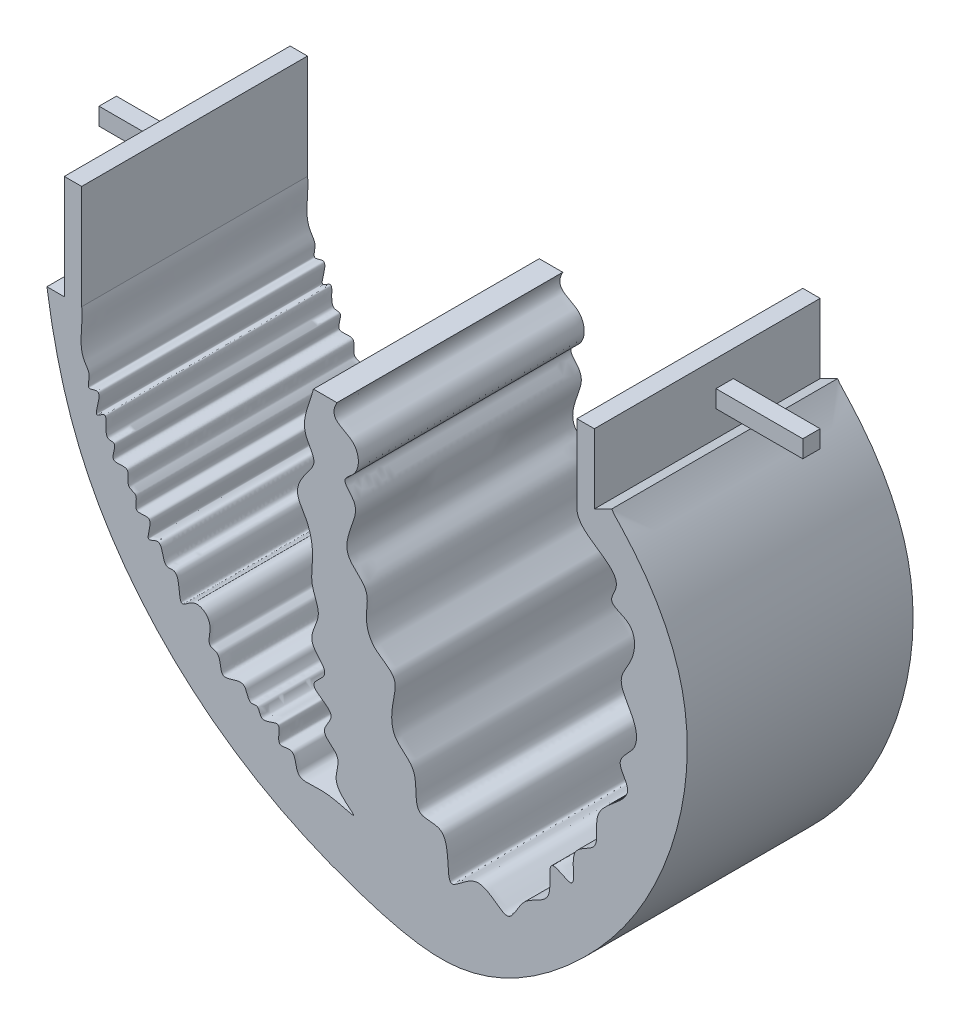
ISO-10303-21;
HEADER;
FILE_DESCRIPTION(('STEP AP214'),'2;1');
FILE_NAME('part.step','',(''),(''),'','','');
FILE_SCHEMA(('AUTOMOTIVE_DESIGN { 1 0 10303 214 1 1 1 1 }'));
ENDSEC;
DATA;
#1=APPLICATION_CONTEXT('core data for automotive mechanical design processes');
#2=APPLICATION_PROTOCOL_DEFINITION('international standard','automotive_design',2000,#1);
#3=PRODUCT_CONTEXT('',#1,'mechanical');
#4=PRODUCT('Part','Part','',(#3));
#5=PRODUCT_RELATED_PRODUCT_CATEGORY('part','',(#4));
#6=PRODUCT_DEFINITION_FORMATION('','',#4);
#7=PRODUCT_DEFINITION_CONTEXT('part definition',#1,'design');
#8=PRODUCT_DEFINITION('design','',#6,#7);
#9=PRODUCT_DEFINITION_SHAPE('','',#8);
#10=(LENGTH_UNIT() NAMED_UNIT(*) SI_UNIT(.MILLI.,.METRE.));
#11=(NAMED_UNIT(*) PLANE_ANGLE_UNIT() SI_UNIT($,.RADIAN.));
#12=(NAMED_UNIT(*) SI_UNIT($,.STERADIAN.) SOLID_ANGLE_UNIT());
#13=UNCERTAINTY_MEASURE_WITH_UNIT(LENGTH_MEASURE(1.E-05),#10,'distance_accuracy_value','');
#14=(GEOMETRIC_REPRESENTATION_CONTEXT(3) GLOBAL_UNCERTAINTY_ASSIGNED_CONTEXT((#13)) GLOBAL_UNIT_ASSIGNED_CONTEXT((#10,
#11,#12)) REPRESENTATION_CONTEXT('',''));
#15=CARTESIAN_POINT('',(0.,0.,0.));
#16=DIRECTION('',(0.,0.,1.));
#17=DIRECTION('',(1.,0.,0.));
#18=AXIS2_PLACEMENT_3D('',#15,#16,#17);
#19=CARTESIAN_POINT('',(236.028465064925,325.589175179673,33.02));
#20=DIRECTION('',(-1.,0.,0.));
#21=DIRECTION('',(0.,0.,1.));
#22=AXIS2_PLACEMENT_3D('',#19,#20,#21);
#23=PLANE('',#22);
#24=DIRECTION('',(0.,1.,0.));
#25=VECTOR('',#24,1.);
#26=CARTESIAN_POINT('',(236.028465064925,325.589175179673,0.));
#27=LINE('',#26,#25);
#28=CARTESIAN_POINT('',(236.028465064925,315.429175179673,0.));
#29=VERTEX_POINT('',#28);
#30=CARTESIAN_POINT('',(236.028465064925,325.589175179673,0.));
#31=VERTEX_POINT('',#30);
#32=EDGE_CURVE('E698',#29,#31,#27,.T.);
#33=ORIENTED_EDGE('',*,*,#32,.T.);
#34=DIRECTION('',(0.,0.,-1.));
#35=VECTOR('',#34,1.);
#36=CARTESIAN_POINT('',(236.028465064925,325.589175179673,33.02));
#37=LINE('',#36,#35);
#38=CARTESIAN_POINT('',(236.028465064925,325.589175179673,33.02));
#39=VERTEX_POINT('',#38);
#40=EDGE_CURVE('E705',#39,#31,#37,.T.);
#41=ORIENTED_EDGE('',*,*,#40,.F.);
#42=DIRECTION('',(0.,1.,0.));
#43=VECTOR('',#42,1.);
#44=CARTESIAN_POINT('',(236.028465064925,325.589175179673,33.02));
#45=LINE('',#44,#43);
#46=CARTESIAN_POINT('',(236.028465064925,315.429175179673,33.02));
#47=VERTEX_POINT('',#46);
#48=EDGE_CURVE('E703',#47,#39,#45,.T.);
#49=ORIENTED_EDGE('',*,*,#48,.F.);
#50=DIRECTION('',(0.,0.,-1.));
#51=VECTOR('',#50,1.);
#52=CARTESIAN_POINT('',(236.028465064925,315.429175179673,33.02));
#53=LINE('',#52,#51);
#54=EDGE_CURVE('E691',#47,#29,#53,.T.);
#55=ORIENTED_EDGE('',*,*,#54,.T.);
#56=EDGE_LOOP('',(#33,#41,#49,#55));
#57=FACE_BOUND('',#56,.T.);
#58=DIRECTION('',(0.,1.,0.));
#59=VECTOR('',#58,1.);
#60=CARTESIAN_POINT('',(236.028465064925,321.779175179673,12.7));
#61=LINE('',#60,#59);
#62=CARTESIAN_POINT('',(236.028465064925,319.239175179673,12.7));
#63=VERTEX_POINT('',#62);
#64=CARTESIAN_POINT('',(236.028465064925,321.779175179673,12.7));
#65=VERTEX_POINT('',#64);
#66=EDGE_CURVE('E211',#63,#65,#61,.T.);
#67=ORIENTED_EDGE('',*,*,#66,.F.);
#68=DIRECTION('',(0.,0.,-1.));
#69=VECTOR('',#68,1.);
#70=CARTESIAN_POINT('',(236.028465064925,319.239175179673,15.24));
#71=LINE('',#70,#69);
#72=CARTESIAN_POINT('',(236.028465064925,319.239175179673,15.24));
#73=VERTEX_POINT('',#72);
#74=EDGE_CURVE('E208',#73,#63,#71,.T.);
#75=ORIENTED_EDGE('',*,*,#74,.F.);
#76=DIRECTION('',(0.,-1.,0.));
#77=VECTOR('',#76,1.);
#78=CARTESIAN_POINT('',(236.028465064925,321.779175179673,15.24));
#79=LINE('',#78,#77);
#80=CARTESIAN_POINT('',(236.028465064925,321.779175179673,15.24));
#81=VERTEX_POINT('',#80);
#82=EDGE_CURVE('E72',#81,#73,#79,.T.);
#83=ORIENTED_EDGE('',*,*,#82,.F.);
#84=DIRECTION('',(0.,0.,1.));
#85=VECTOR('',#84,1.);
#86=CARTESIAN_POINT('',(236.028465064925,321.779175179673,15.24));
#87=LINE('',#86,#85);
#88=EDGE_CURVE('E67',#65,#81,#87,.T.);
#89=ORIENTED_EDGE('',*,*,#88,.F.);
#90=EDGE_LOOP('',(#67,#75,#83,#89));
#91=FACE_BOUND('',#90,.T.);
#92=ADVANCED_FACE('F51',(#57,#91),#23,.F.);
#93=CARTESIAN_POINT('',(158.529333214009,303.552172989733,33.02));
#94=DIRECTION('',(1.,0.,0.));
#95=DIRECTION('',(0.,1.,0.));
#96=AXIS2_PLACEMENT_3D('',#93,#94,#95);
#97=PLANE('',#96);
#98=DIRECTION('',(0.,-1.,0.));
#99=VECTOR('',#98,1.);
#100=CARTESIAN_POINT('',(158.529333214009,303.552172989733,0.));
#101=LINE('',#100,#99);
#102=CARTESIAN_POINT('',(158.529333214009,318.792172989733,0.));
#103=VERTEX_POINT('',#102);
#104=CARTESIAN_POINT('',(158.529333214009,303.552172989733,0.));
#105=VERTEX_POINT('',#104);
#106=EDGE_CURVE('E264',#103,#105,#101,.T.);
#107=ORIENTED_EDGE('',*,*,#106,.T.);
#108=DIRECTION('',(0.,0.,-1.));
#109=VECTOR('',#108,1.);
#110=CARTESIAN_POINT('',(158.529333214009,303.552172989733,33.02));
#111=LINE('',#110,#109);
#112=CARTESIAN_POINT('',(158.529333214009,303.552172989733,33.02));
#113=VERTEX_POINT('',#112);
#114=EDGE_CURVE('E11',#113,#105,#111,.T.);
#115=ORIENTED_EDGE('',*,*,#114,.F.);
#116=DIRECTION('',(0.,-1.,0.));
#117=VECTOR('',#116,1.);
#118=CARTESIAN_POINT('',(158.529333214009,303.552172989733,33.02));
#119=LINE('',#118,#117);
#120=CARTESIAN_POINT('',(158.529333214009,318.792172989733,33.02));
#121=VERTEX_POINT('',#120);
#122=EDGE_CURVE('E265',#121,#113,#119,.T.);
#123=ORIENTED_EDGE('',*,*,#122,.F.);
#124=DIRECTION('',(0.,0.,-1.));
#125=VECTOR('',#124,1.);
#126=CARTESIAN_POINT('',(158.529333214009,318.792172989733,33.02));
#127=LINE('',#126,#125);
#128=EDGE_CURVE('E744',#121,#103,#127,.T.);
#129=ORIENTED_EDGE('',*,*,#128,.T.);
#130=EDGE_LOOP('',(#107,#115,#123,#129));
#131=FACE_BOUND('',#130,.T.);
#132=DIRECTION('',(0.,1.,0.));
#133=VECTOR('',#132,1.);
#134=CARTESIAN_POINT('',(158.529333214009,312.442172989733,15.24));
#135=LINE('',#134,#133);
#136=CARTESIAN_POINT('',(158.529333214009,309.902172989733,15.24));
#137=VERTEX_POINT('',#136);
#138=CARTESIAN_POINT('',(158.529333214009,312.442172989733,15.24));
#139=VERTEX_POINT('',#138);
#140=EDGE_CURVE('E213',#137,#139,#135,.T.);
#141=ORIENTED_EDGE('',*,*,#140,.F.);
#142=DIRECTION('',(0.,0.,1.));
#143=VECTOR('',#142,1.);
#144=CARTESIAN_POINT('',(158.529333214009,309.902172989733,12.7));
#145=LINE('',#144,#143);
#146=CARTESIAN_POINT('',(158.529333214009,309.902172989733,12.7));
#147=VERTEX_POINT('',#146);
#148=EDGE_CURVE('E229',#147,#137,#145,.T.);
#149=ORIENTED_EDGE('',*,*,#148,.F.);
#150=DIRECTION('',(0.,-1.,0.));
#151=VECTOR('',#150,1.);
#152=CARTESIAN_POINT('',(158.529333214009,312.442172989733,12.7));
#153=LINE('',#152,#151);
#154=CARTESIAN_POINT('',(158.529333214009,312.442172989733,12.7));
#155=VERTEX_POINT('',#154);
#156=EDGE_CURVE('E242',#155,#147,#153,.T.);
#157=ORIENTED_EDGE('',*,*,#156,.F.);
#158=DIRECTION('',(0.,0.,-1.));
#159=VECTOR('',#158,1.);
#160=CARTESIAN_POINT('',(158.529333214009,312.442172989733,12.7));
#161=LINE('',#160,#159);
#162=EDGE_CURVE('E218',#139,#155,#161,.T.);
#163=ORIENTED_EDGE('',*,*,#162,.F.);
#164=EDGE_LOOP('',(#141,#149,#157,#163));
#165=FACE_BOUND('',#164,.T.);
#166=ADVANCED_FACE('F53',(#131,#165),#97,.F.);
#167=CARTESIAN_POINT('',(155.989333214009,303.552172989734,33.02));
#168=DIRECTION('',(-2.18547839493142E-13,-1.,0.));
#169=DIRECTION('',(1.,-2.18547839493142E-13,0.));
#170=AXIS2_PLACEMENT_3D('',#167,#168,#169);
#171=PLANE('',#170);
#172=DIRECTION('',(-1.,2.18547839493142E-13,0.));
#173=VECTOR('',#172,1.);
#174=CARTESIAN_POINT('',(155.989333214009,303.552172989734,0.));
#175=LINE('',#174,#173);
#176=CARTESIAN_POINT('',(155.989333214009,303.552172989734,0.));
#177=VERTEX_POINT('',#176);
#178=EDGE_CURVE('E780',#105,#177,#175,.T.);
#179=ORIENTED_EDGE('',*,*,#178,.T.);
#180=DIRECTION('',(0.,0.,-1.));
#181=VECTOR('',#180,1.);
#182=CARTESIAN_POINT('',(155.989333214009,303.552172989734,33.02));
#183=LINE('',#182,#181);
#184=CARTESIAN_POINT('',(155.989333214009,303.552172989734,33.02));
#185=VERTEX_POINT('',#184);
#186=EDGE_CURVE('E60',#185,#177,#183,.T.);
#187=ORIENTED_EDGE('',*,*,#186,.F.);
#188=DIRECTION('',(-1.,2.18547839493142E-13,0.));
#189=VECTOR('',#188,1.);
#190=CARTESIAN_POINT('',(155.989333214009,303.552172989734,33.02));
#191=LINE('',#190,#189);
#192=EDGE_CURVE('E269',#113,#185,#191,.T.);
#193=ORIENTED_EDGE('',*,*,#192,.F.);
#194=ORIENTED_EDGE('',*,*,#114,.T.);
#195=EDGE_LOOP('',(#179,#187,#193,#194));
#196=FACE_BOUND('',#195,.T.);
#197=ADVANCED_FACE('F289',(#196),#171,.F.);
#198=CARTESIAN_POINT('',(155.989333214009,303.552172989734,33.02));
#199=CARTESIAN_POINT('',(156.987406159958,296.711766362536,33.02));
#200=CARTESIAN_POINT('',(160.903271146754,280.758367255002,33.02));
#201=CARTESIAN_POINT('',(177.679801190773,260.252616427949,33.02));
#202=CARTESIAN_POINT('',(198.008810057512,250.052656776356,33.02));
#203=CARTESIAN_POINT('',(218.121524922759,245.457478504978,33.02));
#204=CARTESIAN_POINT('',(234.434067504064,256.063238467454,33.02));
#205=CARTESIAN_POINT('',(247.820952481392,274.206001168337,33.02));
#206=CARTESIAN_POINT('',(252.025485833664,297.864311981296,33.02));
#207=CARTESIAN_POINT('',(243.492208313162,311.503972459356,33.02));
#208=CARTESIAN_POINT('',(238.944116052718,316.140928761056,33.02));
#209=CARTESIAN_POINT('',(238.568465064925,316.699175179673,33.02));
#210=B_SPLINE_CURVE_WITH_KNOTS('',3,(#198,#199,#200,#201,#202,#203,#204,#205,#206,#207,#208,
#209),.UNSPECIFIED.,.F.,.F.,(4,1,1,1,1,1,1,1,1,4),(0.120046571813157,0.18483385758498,
0.273021776294878,0.359649236978444,0.397816633725217,0.461195161311988,0.526426676141084,
0.612455038105468,0.666069006609974,0.672633998429617),.UNSPECIFIED.);
#211=DIRECTION('',(0.,0.,-1.));
#212=VECTOR('',#211,1.);
#213=SURFACE_OF_LINEAR_EXTRUSION('',#210,#212);
#214=CARTESIAN_POINT('',(155.989333214009,303.552172989734,0.));
#215=CARTESIAN_POINT('',(156.987406159958,296.711766362536,0.));
#216=CARTESIAN_POINT('',(160.903271146754,280.758367255002,0.));
#217=CARTESIAN_POINT('',(177.679801190773,260.252616427949,0.));
#218=CARTESIAN_POINT('',(198.008810057512,250.052656776356,0.));
#219=CARTESIAN_POINT('',(218.121524922759,245.457478504978,0.));
#220=CARTESIAN_POINT('',(234.434067504064,256.063238467454,0.));
#221=CARTESIAN_POINT('',(247.820952481392,274.206001168337,0.));
#222=CARTESIAN_POINT('',(252.025485833664,297.864311981296,0.));
#223=CARTESIAN_POINT('',(243.492208313162,311.503972459356,0.));
#224=CARTESIAN_POINT('',(238.944116052718,316.140928761056,0.));
#225=CARTESIAN_POINT('',(238.568465064925,316.699175179673,0.));
#226=B_SPLINE_CURVE_WITH_KNOTS('',3,(#214,#215,#216,#217,#218,#219,#220,#221,#222,#223,#224,
#225),.UNSPECIFIED.,.F.,.F.,(4,1,1,1,1,1,1,1,1,4),(0.120046571813157,0.18483385758498,
0.273021776294878,0.359649236978444,0.397816633725217,0.461195161311988,0.526426676141084,
0.612455038105468,0.666069006609974,0.672633998429617),.UNSPECIFIED.);
#227=CARTESIAN_POINT('',(238.568465064925,316.699175179673,0.));
#228=VERTEX_POINT('',#227);
#229=EDGE_CURVE('E699',#177,#228,#226,.T.);
#230=ORIENTED_EDGE('',*,*,#229,.T.);
#231=DIRECTION('',(0.,0.,-1.));
#232=VECTOR('',#231,1.);
#233=CARTESIAN_POINT('',(238.568465064925,316.699175179673,33.02));
#234=LINE('',#233,#232);
#235=CARTESIAN_POINT('',(238.568465064925,316.699175179673,33.02));
#236=VERTEX_POINT('',#235);
#237=EDGE_CURVE('E694',#236,#228,#234,.T.);
#238=ORIENTED_EDGE('',*,*,#237,.F.);
#239=EDGE_CURVE('E273',#185,#236,#210,.T.);
#240=ORIENTED_EDGE('',*,*,#239,.F.);
#241=ORIENTED_EDGE('',*,*,#186,.T.);
#242=EDGE_LOOP('',(#230,#238,#240,#241));
#243=FACE_BOUND('',#242,.T.);
#244=ADVANCED_FACE('F285',(#243),#213,.F.);
#245=CARTESIAN_POINT('',(236.028465064925,315.429175179673,33.02));
#246=DIRECTION('',(0.447213595499958,-0.894427190999916,0.));
#247=DIRECTION('',(0.894427190999916,0.447213595499958,0.));
#248=AXIS2_PLACEMENT_3D('',#245,#246,#247);
#249=PLANE('',#248);
#250=DIRECTION('',(-0.894427190999916,-0.447213595499958,0.));
#251=VECTOR('',#250,1.);
#252=CARTESIAN_POINT('',(236.028465064925,315.429175179673,0.));
#253=LINE('',#252,#251);
#254=EDGE_CURVE('E688',#228,#29,#253,.T.);
#255=ORIENTED_EDGE('',*,*,#254,.T.);
#256=ORIENTED_EDGE('',*,*,#54,.F.);
#257=DIRECTION('',(-0.894427190999916,-0.447213595499958,0.));
#258=VECTOR('',#257,1.);
#259=CARTESIAN_POINT('',(236.028465064925,315.429175179673,33.02));
#260=LINE('',#259,#258);
#261=EDGE_CURVE('E279',#236,#47,#260,.T.);
#262=ORIENTED_EDGE('',*,*,#261,.F.);
#263=ORIENTED_EDGE('',*,*,#237,.T.);
#264=EDGE_LOOP('',(#255,#256,#262,#263));
#265=FACE_BOUND('',#264,.T.);
#266=ADVANCED_FACE('F288',(#265),#249,.F.);
#267=CARTESIAN_POINT('',(233.488465064925,325.589175179673,33.02));
#268=DIRECTION('',(0.,-1.,0.));
#269=DIRECTION('',(0.,0.,-1.));
#270=AXIS2_PLACEMENT_3D('',#267,#268,#269);
#271=PLANE('',#270);
#272=DIRECTION('',(-1.,0.,0.));
#273=VECTOR('',#272,1.);
#274=CARTESIAN_POINT('',(233.488465064925,325.589175179673,0.));
#275=LINE('',#274,#273);
#276=CARTESIAN_POINT('',(233.488465064925,325.589175179673,0.));
#277=VERTEX_POINT('',#276);
#278=EDGE_CURVE('E710',#31,#277,#275,.T.);
#279=ORIENTED_EDGE('',*,*,#278,.T.);
#280=DIRECTION('',(0.,0.,-1.));
#281=VECTOR('',#280,1.);
#282=CARTESIAN_POINT('',(233.488465064925,325.589175179673,33.02));
#283=LINE('',#282,#281);
#284=CARTESIAN_POINT('',(233.488465064925,325.589175179673,33.02));
#285=VERTEX_POINT('',#284);
#286=EDGE_CURVE('E769',#285,#277,#283,.T.);
#287=ORIENTED_EDGE('',*,*,#286,.F.);
#288=DIRECTION('',(-1.,0.,0.));
#289=VECTOR('',#288,1.);
#290=CARTESIAN_POINT('',(233.488465064925,325.589175179673,33.02));
#291=LINE('',#290,#289);
#292=EDGE_CURVE('E816',#39,#285,#291,.T.);
#293=ORIENTED_EDGE('',*,*,#292,.F.);
#294=ORIENTED_EDGE('',*,*,#40,.T.);
#295=EDGE_LOOP('',(#279,#287,#293,#294));
#296=FACE_BOUND('',#295,.T.);
#297=ADVANCED_FACE('F303',(#296),#271,.F.);
#298=CARTESIAN_POINT('',(233.488465064925,314.159175179673,33.02));
#299=DIRECTION('',(1.,0.,0.));
#300=DIRECTION('',(0.,0.,-1.));
#301=AXIS2_PLACEMENT_3D('',#298,#299,#300);
#302=PLANE('',#301);
#303=DIRECTION('',(0.,-1.,0.));
#304=VECTOR('',#303,1.);
#305=CARTESIAN_POINT('',(233.488465064925,314.159175179673,0.));
#306=LINE('',#305,#304);
#307=CARTESIAN_POINT('',(233.488465064925,314.159175179673,0.));
#308=VERTEX_POINT('',#307);
#309=EDGE_CURVE('E714',#277,#308,#306,.T.);
#310=ORIENTED_EDGE('',*,*,#309,.T.);
#311=DIRECTION('',(0.,0.,-1.));
#312=VECTOR('',#311,1.);
#313=CARTESIAN_POINT('',(233.488465064925,314.159175179673,33.02));
#314=LINE('',#313,#312);
#315=CARTESIAN_POINT('',(233.488465064925,314.159175179673,33.02));
#316=VERTEX_POINT('',#315);
#317=EDGE_CURVE('E765',#316,#308,#314,.T.);
#318=ORIENTED_EDGE('',*,*,#317,.F.);
#319=DIRECTION('',(0.,-1.,0.));
#320=VECTOR('',#319,1.);
#321=CARTESIAN_POINT('',(233.488465064925,314.159175179673,33.02));
#322=LINE('',#321,#320);
#323=EDGE_CURVE('E326',#285,#316,#322,.T.);
#324=ORIENTED_EDGE('',*,*,#323,.F.);
#325=ORIENTED_EDGE('',*,*,#286,.T.);
#326=EDGE_LOOP('',(#310,#318,#324,#325));
#327=FACE_BOUND('',#326,.T.);
#328=ADVANCED_FACE('F306',(#327),#302,.F.);
#329=CARTESIAN_POINT('',(233.488465064925,314.159175179673,33.02));
#330=CARTESIAN_POINT('',(233.624093519787,310.940387087335,33.02));
#331=CARTESIAN_POINT('',(241.380007541965,309.731740834387,33.02));
#332=CARTESIAN_POINT('',(237.762307949822,304.589064021756,33.02));
#333=CARTESIAN_POINT('',(242.26398275502,303.759120411359,33.02));
#334=CARTESIAN_POINT('',(242.01925976625,299.108516822041,33.02));
#335=CARTESIAN_POINT('',(238.840035328221,295.472438397845,33.02));
#336=CARTESIAN_POINT('',(242.168835112555,291.954059873382,33.02));
#337=CARTESIAN_POINT('',(242.425224320468,287.719555435332,33.02));
#338=CARTESIAN_POINT('',(238.737962858199,285.53946318489,33.02));
#339=CARTESIAN_POINT('',(242.876248600483,281.000941917249,33.02));
#340=CARTESIAN_POINT('',(234.985597895886,278.53919876278,33.02));
#341=CARTESIAN_POINT('',(237.304339276124,272.136674758564,33.02));
#342=CARTESIAN_POINT('',(231.790307916197,271.359891368271,33.02));
#343=CARTESIAN_POINT('',(234.027175710773,264.774709841451,33.02));
#344=CARTESIAN_POINT('',(228.664536323079,268.78237464891,33.02));
#345=CARTESIAN_POINT('',(230.55668082613,261.889000265188,33.02));
#346=CARTESIAN_POINT('',(225.409102594152,261.68182482677,33.02));
#347=CARTESIAN_POINT('',(223.596574731169,255.475841935516,33.02));
#348=CARTESIAN_POINT('',(219.255508952706,261.805020981885,33.02));
#349=CARTESIAN_POINT('',(213.548343037484,254.514732363035,33.02));
#350=CARTESIAN_POINT('',(215.615196685254,264.580704600301,33.02));
#351=CARTESIAN_POINT('',(209.076320883539,263.282570459479,33.02));
#352=CARTESIAN_POINT('',(210.833311208291,269.39823245045,33.02));
#353=CARTESIAN_POINT('',(206.311013714804,271.504161156031,33.02));
#354=CARTESIAN_POINT('',(206.292511733879,275.64360221575,33.02));
#355=CARTESIAN_POINT('',(207.574345548483,279.828476811275,33.02));
#356=CARTESIAN_POINT('',(203.462625416771,281.407786433713,33.02));
#357=CARTESIAN_POINT('',(202.363477488807,284.972651492577,33.02));
#358=CARTESIAN_POINT('',(203.418983169135,288.860017945739,33.02));
#359=CARTESIAN_POINT('',(198.999345505098,291.241370349473,33.02));
#360=CARTESIAN_POINT('',(200.484757513914,295.388724215384,33.02));
#361=CARTESIAN_POINT('',(201.665933406577,298.681721158022,33.02));
#362=CARTESIAN_POINT('',(198.739876768285,300.84093546565,33.02));
#363=CARTESIAN_POINT('',(201.834910174568,302.516226463252,33.02));
#364=CARTESIAN_POINT('',(201.603096528386,307.518127742564,33.02));
#365=CARTESIAN_POINT('',(196.915447652843,307.348988540126,33.02));
#366=CARTESIAN_POINT('',(198.39389774547,310.074192577295,33.02));
#367=B_SPLINE_CURVE_WITH_KNOTS('',3,(#329,#330,#331,#332,#333,#334,#335,#336,#337,#338,#339,
#340,#341,#342,#343,#344,#345,#346,#347,#348,#349,#350,#351,#352,#353,#354,#355,#356,#357,#358,
#359,#360,#361,#362,#363,#364,#365,#366),.UNSPECIFIED.,.F.,.F.,(4,1,1,1,1,1,1,1,1,1,1,1,1,1,1,1,
1,1,1,1,1,1,1,1,1,1,1,1,1,1,1,1,1,1,1,4),(0.,0.0659429892320501,0.0794246481148736,
0.0993540806289712,0.131544493456022,0.156724893871502,0.192388626615118,0.215230881716891,
0.239992462921353,0.259372000988837,0.310606599398988,0.340323445588698,0.366751299412639,
0.395597338762441,0.414913607870548,0.442500702898158,0.475568268374796,0.502327013143903,
0.537353293074238,0.567793948562489,0.611750497809385,0.631954373675336,0.668088076837531,
0.694441930718634,0.723930439646877,0.748711561920439,0.775177792035775,0.799975042034869,
0.823243722437977,0.852303896363902,0.882510550816387,0.904823446612042,0.921786690536577,
0.935134313462108,0.96244502172824,1.),.UNSPECIFIED.);
#368=DIRECTION('',(0.,0.,-1.));
#369=VECTOR('',#368,1.);
#370=SURFACE_OF_LINEAR_EXTRUSION('',#367,#369);
#371=CARTESIAN_POINT('',(233.488465064925,314.159175179673,0.));
#372=CARTESIAN_POINT('',(233.624093519787,310.940387087335,0.));
#373=CARTESIAN_POINT('',(241.380007541965,309.731740834387,0.));
#374=CARTESIAN_POINT('',(237.762307949822,304.589064021756,0.));
#375=CARTESIAN_POINT('',(242.26398275502,303.759120411359,0.));
#376=CARTESIAN_POINT('',(242.01925976625,299.108516822041,0.));
#377=CARTESIAN_POINT('',(238.840035328221,295.472438397845,0.));
#378=CARTESIAN_POINT('',(242.168835112555,291.954059873382,0.));
#379=CARTESIAN_POINT('',(242.425224320468,287.719555435332,0.));
#380=CARTESIAN_POINT('',(238.737962858199,285.53946318489,0.));
#381=CARTESIAN_POINT('',(242.876248600483,281.000941917249,0.));
#382=CARTESIAN_POINT('',(234.985597895886,278.53919876278,0.));
#383=CARTESIAN_POINT('',(237.304339276124,272.136674758564,0.));
#384=CARTESIAN_POINT('',(231.790307916197,271.359891368271,0.));
#385=CARTESIAN_POINT('',(234.027175710773,264.774709841451,0.));
#386=CARTESIAN_POINT('',(228.664536323079,268.78237464891,0.));
#387=CARTESIAN_POINT('',(230.55668082613,261.889000265188,0.));
#388=CARTESIAN_POINT('',(225.409102594152,261.68182482677,0.));
#389=CARTESIAN_POINT('',(223.596574731169,255.475841935516,0.));
#390=CARTESIAN_POINT('',(219.255508952706,261.805020981885,0.));
#391=CARTESIAN_POINT('',(213.548343037484,254.514732363035,0.));
#392=CARTESIAN_POINT('',(215.615196685254,264.580704600301,0.));
#393=CARTESIAN_POINT('',(209.076320883539,263.282570459479,0.));
#394=CARTESIAN_POINT('',(210.833311208291,269.39823245045,0.));
#395=CARTESIAN_POINT('',(206.311013714804,271.504161156031,0.));
#396=CARTESIAN_POINT('',(206.292511733879,275.64360221575,0.));
#397=CARTESIAN_POINT('',(207.574345548483,279.828476811275,0.));
#398=CARTESIAN_POINT('',(203.462625416771,281.407786433713,0.));
#399=CARTESIAN_POINT('',(202.363477488807,284.972651492577,0.));
#400=CARTESIAN_POINT('',(203.418983169135,288.860017945739,0.));
#401=CARTESIAN_POINT('',(198.999345505098,291.241370349473,0.));
#402=CARTESIAN_POINT('',(200.484757513914,295.388724215384,0.));
#403=CARTESIAN_POINT('',(201.665933406577,298.681721158022,0.));
#404=CARTESIAN_POINT('',(198.739876768285,300.84093546565,0.));
#405=CARTESIAN_POINT('',(201.834910174568,302.516226463252,0.));
#406=CARTESIAN_POINT('',(201.603096528386,307.518127742564,0.));
#407=CARTESIAN_POINT('',(196.915447652843,307.348988540126,0.));
#408=CARTESIAN_POINT('',(198.39389774547,310.074192577295,0.));
#409=B_SPLINE_CURVE_WITH_KNOTS('',3,(#371,#372,#373,#374,#375,#376,#377,#378,#379,#380,#381,
#382,#383,#384,#385,#386,#387,#388,#389,#390,#391,#392,#393,#394,#395,#396,#397,#398,#399,#400,
#401,#402,#403,#404,#405,#406,#407,#408),.UNSPECIFIED.,.F.,.F.,(4,1,1,1,1,1,1,1,1,1,1,1,1,1,1,1,
1,1,1,1,1,1,1,1,1,1,1,1,1,1,1,1,1,1,1,4),(0.,0.0659429892320501,0.0794246481148736,
0.0993540806289712,0.131544493456022,0.156724893871502,0.192388626615118,0.215230881716891,
0.239992462921353,0.259372000988837,0.310606599398988,0.340323445588698,0.366751299412639,
0.395597338762441,0.414913607870548,0.442500702898158,0.475568268374796,0.502327013143903,
0.537353293074238,0.567793948562489,0.611750497809385,0.631954373675336,0.668088076837531,
0.694441930718634,0.723930439646877,0.748711561920439,0.775177792035775,0.799975042034869,
0.823243722437977,0.852303896363902,0.882510550816387,0.904823446612042,0.921786690536577,
0.935134313462108,0.96244502172824,1.),.UNSPECIFIED.);
#410=CARTESIAN_POINT('',(198.39389774547,310.074192577295,0.));
#411=VERTEX_POINT('',#410);
#412=EDGE_CURVE('E720',#308,#411,#409,.T.);
#413=ORIENTED_EDGE('',*,*,#412,.T.);
#414=DIRECTION('',(0.,0.,-1.));
#415=VECTOR('',#414,1.);
#416=CARTESIAN_POINT('',(198.39389774547,310.074192577295,33.02));
#417=LINE('',#416,#415);
#418=CARTESIAN_POINT('',(198.39389774547,310.074192577295,33.02));
#419=VERTEX_POINT('',#418);
#420=EDGE_CURVE('E761',#419,#411,#417,.T.);
#421=ORIENTED_EDGE('',*,*,#420,.F.);
#422=EDGE_CURVE('E318',#316,#419,#367,.T.);
#423=ORIENTED_EDGE('',*,*,#422,.F.);
#424=ORIENTED_EDGE('',*,*,#317,.T.);
#425=EDGE_LOOP('',(#413,#421,#423,#424));
#426=FACE_BOUND('',#425,.T.);
#427=ADVANCED_FACE('F310',(#426),#370,.F.);
#428=CARTESIAN_POINT('',(194.95775205665,310.074192577295,33.02));
#429=DIRECTION('',(0.,-1.,0.));
#430=DIRECTION('',(0.,0.,-1.));
#431=AXIS2_PLACEMENT_3D('',#428,#429,#430);
#432=PLANE('',#431);
#433=DIRECTION('',(-1.,0.,0.));
#434=VECTOR('',#433,1.);
#435=CARTESIAN_POINT('',(194.95775205665,310.074192577295,0.));
#436=LINE('',#435,#434);
#437=CARTESIAN_POINT('',(194.95775205665,310.074192577295,0.));
#438=VERTEX_POINT('',#437);
#439=EDGE_CURVE('E725',#411,#438,#436,.T.);
#440=ORIENTED_EDGE('',*,*,#439,.T.);
#441=DIRECTION('',(0.,0.,-1.));
#442=VECTOR('',#441,1.);
#443=CARTESIAN_POINT('',(194.95775205665,310.074192577295,33.02));
#444=LINE('',#443,#442);
#445=CARTESIAN_POINT('',(194.95775205665,310.074192577295,33.02));
#446=VERTEX_POINT('',#445);
#447=EDGE_CURVE('E757',#446,#438,#444,.T.);
#448=ORIENTED_EDGE('',*,*,#447,.F.);
#449=DIRECTION('',(-1.,0.,0.));
#450=VECTOR('',#449,1.);
#451=CARTESIAN_POINT('',(194.95775205665,310.074192577295,33.02));
#452=LINE('',#451,#450);
#453=EDGE_CURVE('E325',#419,#446,#452,.T.);
#454=ORIENTED_EDGE('',*,*,#453,.F.);
#455=ORIENTED_EDGE('',*,*,#420,.T.);
#456=EDGE_LOOP('',(#440,#448,#454,#455));
#457=FACE_BOUND('',#456,.T.);
#458=ADVANCED_FACE('F315',(#457),#432,.F.);
#459=CARTESIAN_POINT('',(194.95775205665,310.074192577295,33.02));
#460=CARTESIAN_POINT('',(194.526049251058,308.067508221375,33.02));
#461=CARTESIAN_POINT('',(192.426617829621,304.654960987556,33.02));
#462=CARTESIAN_POINT('',(195.714369930037,301.016861391349,33.02));
#463=CARTESIAN_POINT('',(193.581450351638,298.595134968269,33.02));
#464=CARTESIAN_POINT('',(191.970285316769,295.800164445418,33.02));
#465=CARTESIAN_POINT('',(194.524163279208,292.560028250857,33.02));
#466=CARTESIAN_POINT('',(195.03877173524,288.854652971712,33.02));
#467=CARTESIAN_POINT('',(194.390135164239,285.006323032628,33.02));
#468=CARTESIAN_POINT('',(196.57764709329,281.633342824558,33.02));
#469=CARTESIAN_POINT('',(193.296432932412,277.882986585141,33.02));
#470=CARTESIAN_POINT('',(198.083023944257,274.988214008888,33.02));
#471=CARTESIAN_POINT('',(193.270736145713,272.343289263829,33.02));
#472=CARTESIAN_POINT('',(199.143171762956,270.569414148564,33.02));
#473=CARTESIAN_POINT('',(195.335032081365,267.323698037176,33.02));
#474=CARTESIAN_POINT('',(199.670322410992,265.418817740573,33.02));
#475=CARTESIAN_POINT('',(197.002323361877,261.668559240666,33.02));
#476=CARTESIAN_POINT('',(202.974451406548,257.947831474862,33.02));
#477=CARTESIAN_POINT('',(196.379463564376,260.56191814876,33.02));
#478=CARTESIAN_POINT('',(192.224062184303,259.014758746978,33.02));
#479=CARTESIAN_POINT('',(192.384556736735,263.3380945338,33.02));
#480=CARTESIAN_POINT('',(189.218368645038,261.889545476099,33.02));
#481=CARTESIAN_POINT('',(190.759796564126,266.316976205983,33.02));
#482=CARTESIAN_POINT('',(187.178602113719,263.620884118461,33.02));
#483=CARTESIAN_POINT('',(187.012140274991,266.062269972725,33.02));
#484=CARTESIAN_POINT('',(185.309756003862,265.438221207013,33.02));
#485=CARTESIAN_POINT('',(185.215469529381,268.850324677057,33.02));
#486=CARTESIAN_POINT('',(180.890278977005,265.740628620185,33.02));
#487=CARTESIAN_POINT('',(181.594929361014,269.70544761964,33.02));
#488=CARTESIAN_POINT('',(179.130644382189,269.932079788127,33.02));
#489=CARTESIAN_POINT('',(180.693618189342,272.950644943339,33.02));
#490=CARTESIAN_POINT('',(177.719374007244,275.13093893044,33.02));
#491=CARTESIAN_POINT('',(174.834707478852,271.780346671696,33.02));
#492=CARTESIAN_POINT('',(175.741245095298,277.39372566792,33.02));
#493=CARTESIAN_POINT('',(172.720075890448,276.446702931347,33.02));
#494=CARTESIAN_POINT('',(173.169747925051,280.331824351177,33.02));
#495=CARTESIAN_POINT('',(169.944834162959,278.129453115146,33.02));
#496=CARTESIAN_POINT('',(172.127688733592,282.503296625352,33.02));
#497=CARTESIAN_POINT('',(168.293856841102,281.067030497378,33.02));
#498=CARTESIAN_POINT('',(169.542549599036,283.841297303595,33.02));
#499=CARTESIAN_POINT('',(167.345906098824,284.04685694178,33.02));
#500=CARTESIAN_POINT('',(168.613727407488,287.081696863565,33.02));
#501=CARTESIAN_POINT('',(164.667456403869,285.661701403321,33.02));
#502=CARTESIAN_POINT('',(166.492842821043,288.881936552271,33.02));
#503=CARTESIAN_POINT('',(163.982202820107,288.495732375973,33.02));
#504=CARTESIAN_POINT('',(165.323907829232,292.617309396667,33.02));
#505=CARTESIAN_POINT('',(162.279019609971,289.833585604627,33.02));
#506=CARTESIAN_POINT('',(164.664329656096,294.931711016695,33.02));
#507=CARTESIAN_POINT('',(161.605590483961,293.268704940164,33.02));
#508=CARTESIAN_POINT('',(162.519217184309,295.577699127912,33.02));
#509=CARTESIAN_POINT('',(160.181391450743,297.999399523298,33.02));
#510=CARTESIAN_POINT('',(161.410718796196,301.513264647213,33.02));
#511=CARTESIAN_POINT('',(161.069333214009,303.552172989734,33.02));
#512=B_SPLINE_CURVE_WITH_KNOTS('',3,(#459,#460,#461,#462,#463,#464,#465,#466,#467,#468,#469,
#470,#471,#472,#473,#474,#475,#476,#477,#478,#479,#480,#481,#482,#483,#484,#485,#486,#487,#488,
#489,#490,#491,#492,#493,#494,#495,#496,#497,#498,#499,#500,#501,#502,#503,#504,#505,#506,#507,
#508,#509,#510,#511),.UNSPECIFIED.,.F.,.F.,(4,1,1,1,1,1,1,1,1,1,1,1,1,1,1,1,1,1,1,1,1,1,1,1,1,1,
1,1,1,1,1,1,1,1,1,1,1,1,1,1,1,1,1,1,1,1,1,1,1,1,4),(0.,0.0502669528667005,0.0722304862220322,
0.0897315665571714,0.115218874041995,0.137750175469759,0.173867173530498,0.198574896733652,
0.224109500040135,0.254871305231762,0.281937840948805,0.30085059966899,0.328747164785862,
0.34842848890697,0.370516305704899,0.397308520050562,0.424986095117402,0.457822349792495,
0.488145543496303,0.505917192431629,0.51797670426196,0.535406128098098,0.553600528687513,
0.563643783385293,0.569411375999799,0.584535267568955,0.607659200161274,0.627452673301438,
0.633518326171849,0.654027473614422,0.675550425978654,0.690038367621861,0.718670232403027,
0.724962151618852,0.746814685441849,0.756700190015776,0.776067553403613,0.789759349561486,
0.804205216159309,0.811253200645999,0.827469762865697,0.842348690879386,0.858268766683848,
0.86353001877118,0.884981317662171,0.893281977995234,0.915835418718222,0.925009889521527,
0.936507722046972,0.948602901404279,1.),.UNSPECIFIED.);
#513=DIRECTION('',(0.,0.,-1.));
#514=VECTOR('',#513,1.);
#515=SURFACE_OF_LINEAR_EXTRUSION('',#512,#514);
#516=CARTESIAN_POINT('',(194.95775205665,310.074192577295,0.));
#517=CARTESIAN_POINT('',(194.526049251058,308.067508221375,0.));
#518=CARTESIAN_POINT('',(192.426617829621,304.654960987556,0.));
#519=CARTESIAN_POINT('',(195.714369930037,301.016861391349,0.));
#520=CARTESIAN_POINT('',(193.581450351638,298.595134968269,0.));
#521=CARTESIAN_POINT('',(191.970285316769,295.800164445418,0.));
#522=CARTESIAN_POINT('',(194.524163279208,292.560028250857,0.));
#523=CARTESIAN_POINT('',(195.03877173524,288.854652971712,0.));
#524=CARTESIAN_POINT('',(194.390135164239,285.006323032628,0.));
#525=CARTESIAN_POINT('',(196.57764709329,281.633342824558,0.));
#526=CARTESIAN_POINT('',(193.296432932412,277.882986585141,0.));
#527=CARTESIAN_POINT('',(198.083023944257,274.988214008888,0.));
#528=CARTESIAN_POINT('',(193.270736145713,272.343289263829,0.));
#529=CARTESIAN_POINT('',(199.143171762956,270.569414148564,0.));
#530=CARTESIAN_POINT('',(195.335032081365,267.323698037176,0.));
#531=CARTESIAN_POINT('',(199.670322410992,265.418817740573,0.));
#532=CARTESIAN_POINT('',(197.002323361877,261.668559240666,0.));
#533=CARTESIAN_POINT('',(202.974451406548,257.947831474862,0.));
#534=CARTESIAN_POINT('',(196.379463564376,260.56191814876,0.));
#535=CARTESIAN_POINT('',(192.224062184303,259.014758746978,0.));
#536=CARTESIAN_POINT('',(192.384556736735,263.3380945338,0.));
#537=CARTESIAN_POINT('',(189.218368645038,261.889545476099,0.));
#538=CARTESIAN_POINT('',(190.759796564126,266.316976205983,0.));
#539=CARTESIAN_POINT('',(187.178602113719,263.620884118461,0.));
#540=CARTESIAN_POINT('',(187.012140274991,266.062269972725,0.));
#541=CARTESIAN_POINT('',(185.309756003862,265.438221207013,0.));
#542=CARTESIAN_POINT('',(185.215469529381,268.850324677057,0.));
#543=CARTESIAN_POINT('',(180.890278977005,265.740628620185,0.));
#544=CARTESIAN_POINT('',(181.594929361014,269.70544761964,0.));
#545=CARTESIAN_POINT('',(179.130644382189,269.932079788127,0.));
#546=CARTESIAN_POINT('',(180.693618189342,272.950644943339,0.));
#547=CARTESIAN_POINT('',(177.719374007244,275.13093893044,0.));
#548=CARTESIAN_POINT('',(174.834707478852,271.780346671696,0.));
#549=CARTESIAN_POINT('',(175.741245095298,277.39372566792,0.));
#550=CARTESIAN_POINT('',(172.720075890448,276.446702931347,0.));
#551=CARTESIAN_POINT('',(173.169747925051,280.331824351177,0.));
#552=CARTESIAN_POINT('',(169.944834162959,278.129453115146,0.));
#553=CARTESIAN_POINT('',(172.127688733592,282.503296625352,0.));
#554=CARTESIAN_POINT('',(168.293856841102,281.067030497378,0.));
#555=CARTESIAN_POINT('',(169.542549599036,283.841297303595,0.));
#556=CARTESIAN_POINT('',(167.345906098824,284.04685694178,0.));
#557=CARTESIAN_POINT('',(168.613727407488,287.081696863565,0.));
#558=CARTESIAN_POINT('',(164.667456403869,285.661701403321,0.));
#559=CARTESIAN_POINT('',(166.492842821043,288.881936552271,0.));
#560=CARTESIAN_POINT('',(163.982202820107,288.495732375973,0.));
#561=CARTESIAN_POINT('',(165.323907829232,292.617309396667,0.));
#562=CARTESIAN_POINT('',(162.279019609971,289.833585604627,0.));
#563=CARTESIAN_POINT('',(164.664329656096,294.931711016695,0.));
#564=CARTESIAN_POINT('',(161.605590483961,293.268704940164,0.));
#565=CARTESIAN_POINT('',(162.519217184309,295.577699127912,0.));
#566=CARTESIAN_POINT('',(160.181391450743,297.999399523298,0.));
#567=CARTESIAN_POINT('',(161.410718796196,301.513264647213,0.));
#568=CARTESIAN_POINT('',(161.069333214009,303.552172989734,0.));
#569=B_SPLINE_CURVE_WITH_KNOTS('',3,(#516,#517,#518,#519,#520,#521,#522,#523,#524,#525,#526,
#527,#528,#529,#530,#531,#532,#533,#534,#535,#536,#537,#538,#539,#540,#541,#542,#543,#544,#545,
#546,#547,#548,#549,#550,#551,#552,#553,#554,#555,#556,#557,#558,#559,#560,#561,#562,#563,#564,
#565,#566,#567,#568),.UNSPECIFIED.,.F.,.F.,(4,1,1,1,1,1,1,1,1,1,1,1,1,1,1,1,1,1,1,1,1,1,1,1,1,1,
1,1,1,1,1,1,1,1,1,1,1,1,1,1,1,1,1,1,1,1,1,1,1,1,4),(0.,0.0502669528667005,0.0722304862220322,
0.0897315665571714,0.115218874041995,0.137750175469759,0.173867173530498,0.198574896733652,
0.224109500040135,0.254871305231762,0.281937840948805,0.30085059966899,0.328747164785862,
0.34842848890697,0.370516305704899,0.397308520050562,0.424986095117402,0.457822349792495,
0.488145543496303,0.505917192431629,0.51797670426196,0.535406128098098,0.553600528687513,
0.563643783385293,0.569411375999799,0.584535267568955,0.607659200161274,0.627452673301438,
0.633518326171849,0.654027473614422,0.675550425978654,0.690038367621861,0.718670232403027,
0.724962151618852,0.746814685441849,0.756700190015776,0.776067553403613,0.789759349561486,
0.804205216159309,0.811253200645999,0.827469762865697,0.842348690879386,0.858268766683848,
0.86353001877118,0.884981317662171,0.893281977995234,0.915835418718222,0.925009889521527,
0.936507722046972,0.948602901404279,1.),.UNSPECIFIED.);
#570=CARTESIAN_POINT('',(161.069333214009,303.552172989734,0.));
#571=VERTEX_POINT('',#570);
#572=EDGE_CURVE('E731',#438,#571,#569,.T.);
#573=ORIENTED_EDGE('',*,*,#572,.T.);
#574=DIRECTION('',(0.,0.,-1.));
#575=VECTOR('',#574,1.);
#576=CARTESIAN_POINT('',(161.069333214009,303.552172989734,33.02));
#577=LINE('',#576,#575);
#578=CARTESIAN_POINT('',(161.069333214009,303.552172989734,33.02));
#579=VERTEX_POINT('',#578);
#580=EDGE_CURVE('E753',#579,#571,#577,.T.);
#581=ORIENTED_EDGE('',*,*,#580,.F.);
#582=EDGE_CURVE('E333',#446,#579,#512,.T.);
#583=ORIENTED_EDGE('',*,*,#582,.F.);
#584=ORIENTED_EDGE('',*,*,#447,.T.);
#585=EDGE_LOOP('',(#573,#581,#583,#584));
#586=FACE_BOUND('',#585,.T.);
#587=ADVANCED_FACE('F344',(#586),#515,.F.);
#588=CARTESIAN_POINT('',(161.069333214009,318.792172989733,33.02));
#589=DIRECTION('',(-1.,0.,0.));
#590=DIRECTION('',(0.,0.,1.));
#591=AXIS2_PLACEMENT_3D('',#588,#589,#590);
#592=PLANE('',#591);
#593=DIRECTION('',(0.,1.,0.));
#594=VECTOR('',#593,1.);
#595=CARTESIAN_POINT('',(161.069333214009,318.792172989733,0.));
#596=LINE('',#595,#594);
#597=CARTESIAN_POINT('',(161.069333214009,318.792172989733,0.));
#598=VERTEX_POINT('',#597);
#599=EDGE_CURVE('E736',#571,#598,#596,.T.);
#600=ORIENTED_EDGE('',*,*,#599,.T.);
#601=DIRECTION('',(0.,0.,-1.));
#602=VECTOR('',#601,1.);
#603=CARTESIAN_POINT('',(161.069333214009,318.792172989733,33.02));
#604=LINE('',#603,#602);
#605=CARTESIAN_POINT('',(161.069333214009,318.792172989733,33.02));
#606=VERTEX_POINT('',#605);
#607=EDGE_CURVE('E748',#606,#598,#604,.T.);
#608=ORIENTED_EDGE('',*,*,#607,.F.);
#609=DIRECTION('',(0.,1.,0.));
#610=VECTOR('',#609,1.);
#611=CARTESIAN_POINT('',(161.069333214009,318.792172989733,33.02));
#612=LINE('',#611,#610);
#613=EDGE_CURVE('E339',#579,#606,#612,.T.);
#614=ORIENTED_EDGE('',*,*,#613,.F.);
#615=ORIENTED_EDGE('',*,*,#580,.T.);
#616=EDGE_LOOP('',(#600,#608,#614,#615));
#617=FACE_BOUND('',#616,.T.);
#618=ADVANCED_FACE('F347',(#617),#592,.F.);
#619=CARTESIAN_POINT('',(158.529333214009,318.792172989733,33.02));
#620=DIRECTION('',(0.,-1.,0.));
#621=DIRECTION('',(0.,0.,-1.));
#622=AXIS2_PLACEMENT_3D('',#619,#620,#621);
#623=PLANE('',#622);
#624=DIRECTION('',(-1.,0.,0.));
#625=VECTOR('',#624,1.);
#626=CARTESIAN_POINT('',(158.529333214009,318.792172989733,0.));
#627=LINE('',#626,#625);
#628=EDGE_CURVE('E270',#598,#103,#627,.T.);
#629=ORIENTED_EDGE('',*,*,#628,.T.);
#630=ORIENTED_EDGE('',*,*,#128,.F.);
#631=DIRECTION('',(-1.,0.,0.));
#632=VECTOR('',#631,1.);
#633=CARTESIAN_POINT('',(158.529333214009,318.792172989733,33.02));
#634=LINE('',#633,#632);
#635=EDGE_CURVE('E749',#606,#121,#634,.T.);
#636=ORIENTED_EDGE('',*,*,#635,.F.);
#637=ORIENTED_EDGE('',*,*,#607,.T.);
#638=EDGE_LOOP('',(#629,#630,#636,#637));
#639=FACE_BOUND('',#638,.T.);
#640=ADVANCED_FACE('F351',(#639),#623,.F.);
#641=CARTESIAN_POINT('',(192.146627770157,262.172715132223,33.02));
#642=DIRECTION('',(0.,0.,1.));
#643=DIRECTION('',(1.,0.,0.));
#644=AXIS2_PLACEMENT_3D('',#641,#642,#643);
#645=PLANE('',#644);
#646=ORIENTED_EDGE('',*,*,#122,.T.);
#647=ORIENTED_EDGE('',*,*,#192,.T.);
#648=ORIENTED_EDGE('',*,*,#239,.T.);
#649=ORIENTED_EDGE('',*,*,#261,.T.);
#650=ORIENTED_EDGE('',*,*,#48,.T.);
#651=ORIENTED_EDGE('',*,*,#292,.T.);
#652=ORIENTED_EDGE('',*,*,#323,.T.);
#653=ORIENTED_EDGE('',*,*,#422,.T.);
#654=ORIENTED_EDGE('',*,*,#453,.T.);
#655=ORIENTED_EDGE('',*,*,#582,.T.);
#656=ORIENTED_EDGE('',*,*,#613,.T.);
#657=ORIENTED_EDGE('',*,*,#635,.T.);
#658=EDGE_LOOP('',(#646,#647,#648,#649,#650,#651,#652,#653,#654,#655,#656,#657));
#659=FACE_BOUND('',#658,.T.);
#660=ADVANCED_FACE('F355',(#659),#645,.T.);
#661=CARTESIAN_POINT('',(192.146627770157,262.172715132223,0.));
#662=DIRECTION('',(0.,0.,1.));
#663=DIRECTION('',(1.,0.,0.));
#664=AXIS2_PLACEMENT_3D('',#661,#662,#663);
#665=PLANE('',#664);
#666=ORIENTED_EDGE('',*,*,#106,.F.);
#667=ORIENTED_EDGE('',*,*,#628,.F.);
#668=ORIENTED_EDGE('',*,*,#599,.F.);
#669=ORIENTED_EDGE('',*,*,#572,.F.);
#670=ORIENTED_EDGE('',*,*,#439,.F.);
#671=ORIENTED_EDGE('',*,*,#412,.F.);
#672=ORIENTED_EDGE('',*,*,#309,.F.);
#673=ORIENTED_EDGE('',*,*,#278,.F.);
#674=ORIENTED_EDGE('',*,*,#32,.F.);
#675=ORIENTED_EDGE('',*,*,#254,.F.);
#676=ORIENTED_EDGE('',*,*,#229,.F.);
#677=ORIENTED_EDGE('',*,*,#178,.F.);
#678=EDGE_LOOP('',(#666,#667,#668,#669,#670,#671,#672,#673,#674,#675,#676,#677));
#679=FACE_BOUND('',#678,.T.);
#680=ADVANCED_FACE('F357',(#679),#665,.F.);
#681=CARTESIAN_POINT('',(145.829333214009,312.442172989733,15.24));
#682=DIRECTION('',(0.,0.,-1.));
#683=DIRECTION('',(-1.,0.,0.));
#684=AXIS2_PLACEMENT_3D('',#681,#682,#683);
#685=PLANE('',#684);
#686=ORIENTED_EDGE('',*,*,#140,.T.);
#687=DIRECTION('',(1.,0.,0.));
#688=VECTOR('',#687,1.);
#689=CARTESIAN_POINT('',(145.829333214009,312.442172989733,15.24));
#690=LINE('',#689,#688);
#691=CARTESIAN_POINT('',(145.829333214009,312.442172989733,15.24));
#692=VERTEX_POINT('',#691);
#693=EDGE_CURVE('E260',#692,#139,#690,.T.);
#694=ORIENTED_EDGE('',*,*,#693,.F.);
#695=DIRECTION('',(0.,1.,0.));
#696=VECTOR('',#695,1.);
#697=CARTESIAN_POINT('',(145.829333214009,312.442172989733,15.24));
#698=LINE('',#697,#696);
#699=CARTESIAN_POINT('',(145.829333214009,309.902172989733,15.24));
#700=VERTEX_POINT('',#699);
#701=EDGE_CURVE('E224',#700,#692,#698,.T.);
#702=ORIENTED_EDGE('',*,*,#701,.F.);
#703=DIRECTION('',(1.,0.,0.));
#704=VECTOR('',#703,1.);
#705=CARTESIAN_POINT('',(145.829333214009,309.902172989733,15.24));
#706=LINE('',#705,#704);
#707=EDGE_CURVE('E237',#700,#137,#706,.T.);
#708=ORIENTED_EDGE('',*,*,#707,.T.);
#709=EDGE_LOOP('',(#686,#694,#702,#708));
#710=FACE_BOUND('',#709,.T.);
#711=ADVANCED_FACE('F360',(#710),#685,.F.);
#712=CARTESIAN_POINT('',(145.829333214009,312.442172989733,12.7));
#713=DIRECTION('',(0.,-1.,0.));
#714=DIRECTION('',(1.,0.,0.));
#715=AXIS2_PLACEMENT_3D('',#712,#713,#714);
#716=PLANE('',#715);
#717=ORIENTED_EDGE('',*,*,#162,.T.);
#718=DIRECTION('',(1.,0.,0.));
#719=VECTOR('',#718,1.);
#720=CARTESIAN_POINT('',(145.829333214009,312.442172989733,12.7));
#721=LINE('',#720,#719);
#722=CARTESIAN_POINT('',(145.829333214009,312.442172989733,12.7));
#723=VERTEX_POINT('',#722);
#724=EDGE_CURVE('E256',#723,#155,#721,.T.);
#725=ORIENTED_EDGE('',*,*,#724,.F.);
#726=DIRECTION('',(0.,0.,-1.));
#727=VECTOR('',#726,1.);
#728=CARTESIAN_POINT('',(145.829333214009,312.442172989733,12.7));
#729=LINE('',#728,#727);
#730=EDGE_CURVE('E228',#692,#723,#729,.T.);
#731=ORIENTED_EDGE('',*,*,#730,.F.);
#732=ORIENTED_EDGE('',*,*,#693,.T.);
#733=EDGE_LOOP('',(#717,#725,#731,#732));
#734=FACE_BOUND('',#733,.T.);
#735=ADVANCED_FACE('F367',(#734),#716,.F.);
#736=CARTESIAN_POINT('',(145.829333214009,312.442172989733,12.7));
#737=DIRECTION('',(0.,0.,1.));
#738=DIRECTION('',(1.,0.,0.));
#739=AXIS2_PLACEMENT_3D('',#736,#737,#738);
#740=PLANE('',#739);
#741=ORIENTED_EDGE('',*,*,#156,.T.);
#742=DIRECTION('',(1.,0.,0.));
#743=VECTOR('',#742,1.);
#744=CARTESIAN_POINT('',(145.829333214009,309.902172989733,12.7));
#745=LINE('',#744,#743);
#746=CARTESIAN_POINT('',(145.829333214009,309.902172989733,12.7));
#747=VERTEX_POINT('',#746);
#748=EDGE_CURVE('E252',#747,#147,#745,.T.);
#749=ORIENTED_EDGE('',*,*,#748,.F.);
#750=DIRECTION('',(0.,-1.,0.));
#751=VECTOR('',#750,1.);
#752=CARTESIAN_POINT('',(145.829333214009,312.442172989733,12.7));
#753=LINE('',#752,#751);
#754=EDGE_CURVE('E232',#723,#747,#753,.T.);
#755=ORIENTED_EDGE('',*,*,#754,.F.);
#756=ORIENTED_EDGE('',*,*,#724,.T.);
#757=EDGE_LOOP('',(#741,#749,#755,#756));
#758=FACE_BOUND('',#757,.T.);
#759=ADVANCED_FACE('F371',(#758),#740,.F.);
#760=CARTESIAN_POINT('',(145.829333214009,309.902172989733,12.7));
#761=DIRECTION('',(0.,1.,0.));
#762=DIRECTION('',(-1.,0.,0.));
#763=AXIS2_PLACEMENT_3D('',#760,#761,#762);
#764=PLANE('',#763);
#765=ORIENTED_EDGE('',*,*,#148,.T.);
#766=ORIENTED_EDGE('',*,*,#707,.F.);
#767=DIRECTION('',(0.,0.,1.));
#768=VECTOR('',#767,1.);
#769=CARTESIAN_POINT('',(145.829333214009,309.902172989733,12.7));
#770=LINE('',#769,#768);
#771=EDGE_CURVE('E235',#747,#700,#770,.T.);
#772=ORIENTED_EDGE('',*,*,#771,.F.);
#773=ORIENTED_EDGE('',*,*,#748,.T.);
#774=EDGE_LOOP('',(#765,#766,#772,#773));
#775=FACE_BOUND('',#774,.T.);
#776=ADVANCED_FACE('F375',(#775),#764,.F.);
#777=CARTESIAN_POINT('',(145.829333214013,1.70918251716419E-12,0.));
#778=DIRECTION('',(-1.,0.,0.));
#779=DIRECTION('',(0.,-1.,0.));
#780=AXIS2_PLACEMENT_3D('',#777,#778,#779);
#781=PLANE('',#780);
#782=ORIENTED_EDGE('',*,*,#701,.T.);
#783=ORIENTED_EDGE('',*,*,#730,.T.);
#784=ORIENTED_EDGE('',*,*,#754,.T.);
#785=ORIENTED_EDGE('',*,*,#771,.T.);
#786=EDGE_LOOP('',(#782,#783,#784,#785));
#787=FACE_BOUND('',#786,.T.);
#788=ADVANCED_FACE('F379',(#787),#781,.T.);
#789=CARTESIAN_POINT('',(248.728465064925,321.779175179673,12.7));
#790=DIRECTION('',(0.,0.,1.));
#791=DIRECTION('',(1.,0.,0.));
#792=AXIS2_PLACEMENT_3D('',#789,#790,#791);
#793=PLANE('',#792);
#794=ORIENTED_EDGE('',*,*,#66,.T.);
#795=DIRECTION('',(-1.,0.,0.));
#796=VECTOR('',#795,1.);
#797=CARTESIAN_POINT('',(248.728465064925,321.779175179673,12.7));
#798=LINE('',#797,#796);
#799=CARTESIAN_POINT('',(248.728465064925,321.779175179673,12.7));
#800=VERTEX_POINT('',#799);
#801=EDGE_CURVE('E190',#800,#65,#798,.T.);
#802=ORIENTED_EDGE('',*,*,#801,.F.);
#803=DIRECTION('',(0.,1.,0.));
#804=VECTOR('',#803,1.);
#805=CARTESIAN_POINT('',(248.728465064925,321.779175179673,12.7));
#806=LINE('',#805,#804);
#807=CARTESIAN_POINT('',(248.728465064925,319.239175179673,12.7));
#808=VERTEX_POINT('',#807);
#809=EDGE_CURVE('E198',#808,#800,#806,.T.);
#810=ORIENTED_EDGE('',*,*,#809,.F.);
#811=DIRECTION('',(-1.,0.,0.));
#812=VECTOR('',#811,1.);
#813=CARTESIAN_POINT('',(248.728465064925,319.239175179673,12.7));
#814=LINE('',#813,#812);
#815=EDGE_CURVE('E830',#808,#63,#814,.T.);
#816=ORIENTED_EDGE('',*,*,#815,.T.);
#817=EDGE_LOOP('',(#794,#802,#810,#816));
#818=FACE_BOUND('',#817,.T.);
#819=ADVANCED_FACE('F210',(#818),#793,.F.);
#820=CARTESIAN_POINT('',(248.728465064925,321.779175179673,15.24));
#821=DIRECTION('',(0.,-1.,0.));
#822=DIRECTION('',(0.,0.,-1.));
#823=AXIS2_PLACEMENT_3D('',#820,#821,#822);
#824=PLANE('',#823);
#825=ORIENTED_EDGE('',*,*,#88,.T.);
#826=DIRECTION('',(-1.,0.,0.));
#827=VECTOR('',#826,1.);
#828=CARTESIAN_POINT('',(248.728465064925,321.779175179673,15.24));
#829=LINE('',#828,#827);
#830=CARTESIAN_POINT('',(248.728465064925,321.779175179673,15.24));
#831=VERTEX_POINT('',#830);
#832=EDGE_CURVE('E193',#831,#81,#829,.T.);
#833=ORIENTED_EDGE('',*,*,#832,.F.);
#834=DIRECTION('',(0.,0.,1.));
#835=VECTOR('',#834,1.);
#836=CARTESIAN_POINT('',(248.728465064925,321.779175179673,15.24));
#837=LINE('',#836,#835);
#838=EDGE_CURVE('E186',#800,#831,#837,.T.);
#839=ORIENTED_EDGE('',*,*,#838,.F.);
#840=ORIENTED_EDGE('',*,*,#801,.T.);
#841=EDGE_LOOP('',(#825,#833,#839,#840));
#842=FACE_BOUND('',#841,.T.);
#843=ADVANCED_FACE('F188',(#842),#824,.F.);
#844=CARTESIAN_POINT('',(248.728465064925,321.779175179673,15.24));
#845=DIRECTION('',(0.,0.,-1.));
#846=DIRECTION('',(-1.,0.,0.));
#847=AXIS2_PLACEMENT_3D('',#844,#845,#846);
#848=PLANE('',#847);
#849=ORIENTED_EDGE('',*,*,#82,.T.);
#850=DIRECTION('',(-1.,0.,0.));
#851=VECTOR('',#850,1.);
#852=CARTESIAN_POINT('',(248.728465064925,319.239175179673,15.24));
#853=LINE('',#852,#851);
#854=CARTESIAN_POINT('',(248.728465064925,319.239175179673,15.24));
#855=VERTEX_POINT('',#854);
#856=EDGE_CURVE('E220',#855,#73,#853,.T.);
#857=ORIENTED_EDGE('',*,*,#856,.F.);
#858=DIRECTION('',(0.,-1.,0.));
#859=VECTOR('',#858,1.);
#860=CARTESIAN_POINT('',(248.728465064925,321.779175179673,15.24));
#861=LINE('',#860,#859);
#862=EDGE_CURVE('E197',#831,#855,#861,.T.);
#863=ORIENTED_EDGE('',*,*,#862,.F.);
#864=ORIENTED_EDGE('',*,*,#832,.T.);
#865=EDGE_LOOP('',(#849,#857,#863,#864));
#866=FACE_BOUND('',#865,.T.);
#867=ADVANCED_FACE('F388',(#866),#848,.F.);
#868=CARTESIAN_POINT('',(248.728465064925,319.239175179673,15.24));
#869=DIRECTION('',(0.,1.,0.));
#870=DIRECTION('',(0.,0.,1.));
#871=AXIS2_PLACEMENT_3D('',#868,#869,#870);
#872=PLANE('',#871);
#873=ORIENTED_EDGE('',*,*,#74,.T.);
#874=ORIENTED_EDGE('',*,*,#815,.F.);
#875=DIRECTION('',(0.,0.,-1.));
#876=VECTOR('',#875,1.);
#877=CARTESIAN_POINT('',(248.728465064925,319.239175179673,15.24));
#878=LINE('',#877,#876);
#879=EDGE_CURVE('E203',#855,#808,#878,.T.);
#880=ORIENTED_EDGE('',*,*,#879,.F.);
#881=ORIENTED_EDGE('',*,*,#856,.T.);
#882=EDGE_LOOP('',(#873,#874,#880,#881));
#883=FACE_BOUND('',#882,.T.);
#884=ADVANCED_FACE('F391',(#883),#872,.F.);
#885=CARTESIAN_POINT('',(248.728465064925,0.,0.));
#886=DIRECTION('',(1.,0.,0.));
#887=DIRECTION('',(0.,0.,-1.));
#888=AXIS2_PLACEMENT_3D('',#885,#886,#887);
#889=PLANE('',#888);
#890=ORIENTED_EDGE('',*,*,#809,.T.);
#891=ORIENTED_EDGE('',*,*,#838,.T.);
#892=ORIENTED_EDGE('',*,*,#862,.T.);
#893=ORIENTED_EDGE('',*,*,#879,.T.);
#894=EDGE_LOOP('',(#890,#891,#892,#893));
#895=FACE_BOUND('',#894,.T.);
#896=ADVANCED_FACE('F201',(#895),#889,.T.);
#897=CLOSED_SHELL('',(#92,#166,#197,#244,#266,#297,#328,#427,#458,#587,#618,#640,#660,#680,#711,
#735,#759,#776,#788,#819,#843,#867,#884,#896));
#898=MANIFOLD_SOLID_BREP('B2',#897);
#899=ADVANCED_BREP_SHAPE_REPRESENTATION('',(#18,#898),#14);
#900=SHAPE_DEFINITION_REPRESENTATION(#9,#899);
ENDSEC;
END-ISO-10303-21;
